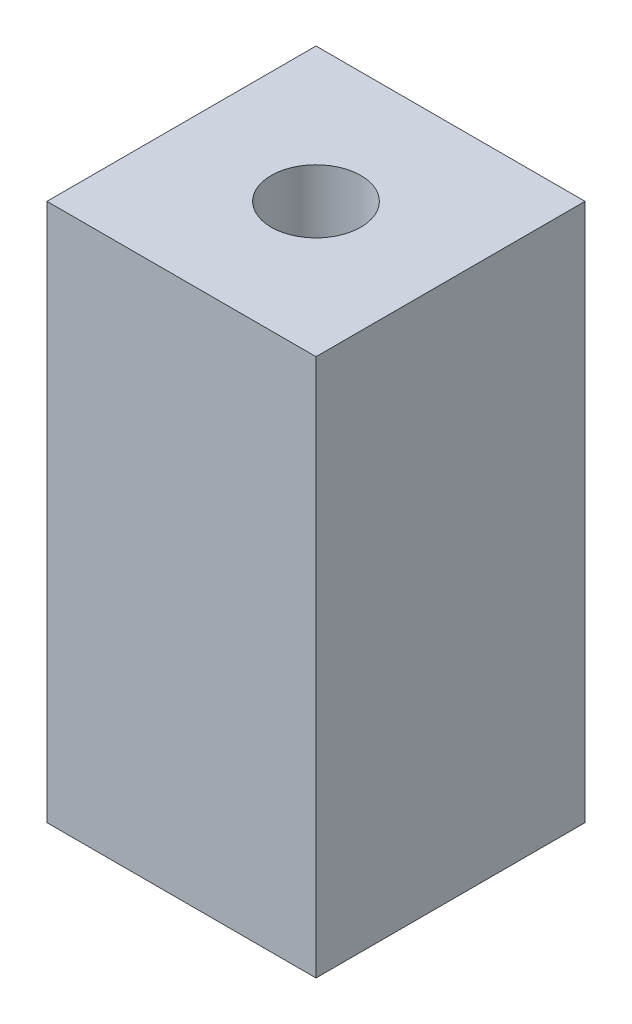
ISO-10303-21;
HEADER;
FILE_DESCRIPTION(('STEP AP214'),'2;1');
FILE_NAME('part.step','',(''),(''),'','','');
FILE_SCHEMA(('AUTOMOTIVE_DESIGN { 1 0 10303 214 1 1 1 1 }'));
ENDSEC;
DATA;
#1=APPLICATION_CONTEXT('core data for automotive mechanical design processes');
#2=APPLICATION_PROTOCOL_DEFINITION('international standard','automotive_design',2000,#1);
#3=PRODUCT_CONTEXT('',#1,'mechanical');
#4=PRODUCT('Part','Part','',(#3));
#5=PRODUCT_RELATED_PRODUCT_CATEGORY('part','',(#4));
#6=PRODUCT_DEFINITION_FORMATION('','',#4);
#7=PRODUCT_DEFINITION_CONTEXT('part definition',#1,'design');
#8=PRODUCT_DEFINITION('design','',#6,#7);
#9=PRODUCT_DEFINITION_SHAPE('','',#8);
#10=(LENGTH_UNIT() NAMED_UNIT(*) SI_UNIT(.MILLI.,.METRE.));
#11=(NAMED_UNIT(*) PLANE_ANGLE_UNIT() SI_UNIT($,.RADIAN.));
#12=(NAMED_UNIT(*) SI_UNIT($,.STERADIAN.) SOLID_ANGLE_UNIT());
#13=UNCERTAINTY_MEASURE_WITH_UNIT(LENGTH_MEASURE(1.E-05),#10,'distance_accuracy_value','');
#14=(GEOMETRIC_REPRESENTATION_CONTEXT(3) GLOBAL_UNCERTAINTY_ASSIGNED_CONTEXT((#13)) GLOBAL_UNIT_ASSIGNED_CONTEXT((#10,
#11,#12)) REPRESENTATION_CONTEXT('',''));
#15=CARTESIAN_POINT('',(0.,0.,0.));
#16=DIRECTION('',(0.,0.,1.));
#17=DIRECTION('',(1.,0.,0.));
#18=AXIS2_PLACEMENT_3D('',#15,#16,#17);
#19=CARTESIAN_POINT('',(0.,38.1,0.));
#20=DIRECTION('',(0.,-1.,0.));
#21=DIRECTION('',(0.,0.,-1.));
#22=AXIS2_PLACEMENT_3D('',#19,#20,#21);
#23=PLANE('',#22);
#24=DIRECTION('',(0.,0.,-1.));
#25=VECTOR('',#24,1.);
#26=CARTESIAN_POINT('',(9.525,38.1,9.525));
#27=LINE('',#26,#25);
#28=CARTESIAN_POINT('',(9.525,38.1,9.525));
#29=VERTEX_POINT('',#28);
#30=CARTESIAN_POINT('',(9.525,38.1,-9.525));
#31=VERTEX_POINT('',#30);
#32=EDGE_CURVE('E85',#29,#31,#27,.T.);
#33=ORIENTED_EDGE('',*,*,#32,.T.);
#34=DIRECTION('',(-1.,0.,0.));
#35=VECTOR('',#34,1.);
#36=CARTESIAN_POINT('',(-9.525,38.1,-9.525));
#37=LINE('',#36,#35);
#38=CARTESIAN_POINT('',(-9.525,38.1,-9.525));
#39=VERTEX_POINT('',#38);
#40=EDGE_CURVE('E80',#31,#39,#37,.T.);
#41=ORIENTED_EDGE('',*,*,#40,.T.);
#42=DIRECTION('',(0.,0.,1.));
#43=VECTOR('',#42,1.);
#44=CARTESIAN_POINT('',(-9.525,38.1,9.525));
#45=LINE('',#44,#43);
#46=CARTESIAN_POINT('',(-9.525,38.1,9.525));
#47=VERTEX_POINT('',#46);
#48=EDGE_CURVE('E83',#39,#47,#45,.T.);
#49=ORIENTED_EDGE('',*,*,#48,.T.);
#50=DIRECTION('',(1.,0.,0.));
#51=VECTOR('',#50,1.);
#52=CARTESIAN_POINT('',(-9.525,38.1,9.525));
#53=LINE('',#52,#51);
#54=EDGE_CURVE('E50',#47,#29,#53,.T.);
#55=ORIENTED_EDGE('',*,*,#54,.T.);
#56=EDGE_LOOP('',(#33,#41,#49,#55));
#57=FACE_BOUND('',#56,.T.);
#58=CARTESIAN_POINT('',(0.,38.1,0.));
#59=DIRECTION('',(0.,1.,0.));
#60=DIRECTION('',(0.,0.,1.));
#61=AXIS2_PLACEMENT_3D('',#58,#59,#60);
#62=CIRCLE('',#61,3.175);
#63=CARTESIAN_POINT('',(0.,38.1,3.175));
#64=VERTEX_POINT('',#63);
#65=EDGE_CURVE('E100',#64,#64,#62,.T.);
#66=ORIENTED_EDGE('',*,*,#65,.F.);
#67=EDGE_LOOP('',(#66));
#68=FACE_BOUND('',#67,.T.);
#69=ADVANCED_FACE('F33',(#57,#68),#23,.F.);
#70=CARTESIAN_POINT('',(0.,0.,0.));
#71=DIRECTION('',(0.,-1.,0.));
#72=DIRECTION('',(0.,0.,-1.));
#73=AXIS2_PLACEMENT_3D('',#70,#71,#72);
#74=PLANE('',#73);
#75=DIRECTION('',(0.,0.,-1.));
#76=VECTOR('',#75,1.);
#77=CARTESIAN_POINT('',(9.525,0.,9.525));
#78=LINE('',#77,#76);
#79=CARTESIAN_POINT('',(9.525,0.,9.525));
#80=VERTEX_POINT('',#79);
#81=CARTESIAN_POINT('',(9.525,0.,-9.525));
#82=VERTEX_POINT('',#81);
#83=EDGE_CURVE('E97',#80,#82,#78,.T.);
#84=ORIENTED_EDGE('',*,*,#83,.F.);
#85=DIRECTION('',(1.,0.,0.));
#86=VECTOR('',#85,1.);
#87=CARTESIAN_POINT('',(-9.525,0.,9.525));
#88=LINE('',#87,#86);
#89=CARTESIAN_POINT('',(-9.525,0.,9.525));
#90=VERTEX_POINT('',#89);
#91=EDGE_CURVE('E73',#90,#80,#88,.T.);
#92=ORIENTED_EDGE('',*,*,#91,.F.);
#93=DIRECTION('',(0.,0.,1.));
#94=VECTOR('',#93,1.);
#95=CARTESIAN_POINT('',(-9.525,0.,9.525));
#96=LINE('',#95,#94);
#97=CARTESIAN_POINT('',(-9.525,0.,-9.525));
#98=VERTEX_POINT('',#97);
#99=EDGE_CURVE('E67',#98,#90,#96,.T.);
#100=ORIENTED_EDGE('',*,*,#99,.F.);
#101=DIRECTION('',(-1.,0.,0.));
#102=VECTOR('',#101,1.);
#103=CARTESIAN_POINT('',(-9.525,0.,-9.525));
#104=LINE('',#103,#102);
#105=EDGE_CURVE('E89',#82,#98,#104,.T.);
#106=ORIENTED_EDGE('',*,*,#105,.F.);
#107=EDGE_LOOP('',(#84,#92,#100,#106));
#108=FACE_BOUND('',#107,.T.);
#109=CARTESIAN_POINT('',(0.,0.,0.));
#110=DIRECTION('',(0.,1.,0.));
#111=DIRECTION('',(0.,0.,1.));
#112=AXIS2_PLACEMENT_3D('',#109,#110,#111);
#113=CIRCLE('',#112,3.175);
#114=CARTESIAN_POINT('',(0.,0.,3.175));
#115=VERTEX_POINT('',#114);
#116=EDGE_CURVE('E112',#115,#115,#113,.T.);
#117=ORIENTED_EDGE('',*,*,#116,.T.);
#118=EDGE_LOOP('',(#117));
#119=FACE_BOUND('',#118,.T.);
#120=ADVANCED_FACE('F108',(#108,#119),#74,.T.);
#121=CARTESIAN_POINT('',(9.525,38.1,9.525));
#122=DIRECTION('',(-1.,0.,0.));
#123=DIRECTION('',(0.,0.,1.));
#124=AXIS2_PLACEMENT_3D('',#121,#122,#123);
#125=PLANE('',#124);
#126=ORIENTED_EDGE('',*,*,#83,.T.);
#127=DIRECTION('',(0.,-1.,0.));
#128=VECTOR('',#127,1.);
#129=CARTESIAN_POINT('',(9.525,38.1,-9.525));
#130=LINE('',#129,#128);
#131=EDGE_CURVE('E11',#31,#82,#130,.T.);
#132=ORIENTED_EDGE('',*,*,#131,.F.);
#133=ORIENTED_EDGE('',*,*,#32,.F.);
#134=DIRECTION('',(0.,-1.,0.));
#135=VECTOR('',#134,1.);
#136=CARTESIAN_POINT('',(9.525,38.1,9.525));
#137=LINE('',#136,#135);
#138=EDGE_CURVE('E93',#29,#80,#137,.T.);
#139=ORIENTED_EDGE('',*,*,#138,.T.);
#140=EDGE_LOOP('',(#126,#132,#133,#139));
#141=FACE_BOUND('',#140,.T.);
#142=ADVANCED_FACE('F35',(#141),#125,.F.);
#143=CARTESIAN_POINT('',(-9.525,38.1,-9.525));
#144=DIRECTION('',(0.,0.,1.));
#145=DIRECTION('',(1.,0.,0.));
#146=AXIS2_PLACEMENT_3D('',#143,#144,#145);
#147=PLANE('',#146);
#148=ORIENTED_EDGE('',*,*,#105,.T.);
#149=DIRECTION('',(0.,-1.,0.));
#150=VECTOR('',#149,1.);
#151=CARTESIAN_POINT('',(-9.525,38.1,-9.525));
#152=LINE('',#151,#150);
#153=EDGE_CURVE('E42',#39,#98,#152,.T.);
#154=ORIENTED_EDGE('',*,*,#153,.F.);
#155=ORIENTED_EDGE('',*,*,#40,.F.);
#156=ORIENTED_EDGE('',*,*,#131,.T.);
#157=EDGE_LOOP('',(#148,#154,#155,#156));
#158=FACE_BOUND('',#157,.T.);
#159=ADVANCED_FACE('F88',(#158),#147,.F.);
#160=CARTESIAN_POINT('',(-9.525,38.1,9.525));
#161=DIRECTION('',(1.,0.,0.));
#162=DIRECTION('',(0.,0.,-1.));
#163=AXIS2_PLACEMENT_3D('',#160,#161,#162);
#164=PLANE('',#163);
#165=ORIENTED_EDGE('',*,*,#99,.T.);
#166=DIRECTION('',(0.,-1.,0.));
#167=VECTOR('',#166,1.);
#168=CARTESIAN_POINT('',(-9.525,38.1,9.525));
#169=LINE('',#168,#167);
#170=EDGE_CURVE('E90',#47,#90,#169,.T.);
#171=ORIENTED_EDGE('',*,*,#170,.F.);
#172=ORIENTED_EDGE('',*,*,#48,.F.);
#173=ORIENTED_EDGE('',*,*,#153,.T.);
#174=EDGE_LOOP('',(#165,#171,#172,#173));
#175=FACE_BOUND('',#174,.T.);
#176=ADVANCED_FACE('F91',(#175),#164,.F.);
#177=CARTESIAN_POINT('',(-9.525,38.1,9.525));
#178=DIRECTION('',(0.,0.,-1.));
#179=DIRECTION('',(-1.,0.,0.));
#180=AXIS2_PLACEMENT_3D('',#177,#178,#179);
#181=PLANE('',#180);
#182=ORIENTED_EDGE('',*,*,#91,.T.);
#183=ORIENTED_EDGE('',*,*,#138,.F.);
#184=ORIENTED_EDGE('',*,*,#54,.F.);
#185=ORIENTED_EDGE('',*,*,#170,.T.);
#186=EDGE_LOOP('',(#182,#183,#184,#185));
#187=FACE_BOUND('',#186,.T.);
#188=ADVANCED_FACE('F105',(#187),#181,.F.);
#189=CARTESIAN_POINT('',(0.,38.1,0.));
#190=DIRECTION('',(0.,-1.,0.));
#191=DIRECTION('',(0.,0.,-1.));
#192=AXIS2_PLACEMENT_3D('',#189,#190,#191);
#193=CYLINDRICAL_SURFACE('',#192,3.175);
#194=ORIENTED_EDGE('',*,*,#65,.T.);
#195=EDGE_LOOP('',(#194));
#196=FACE_BOUND('',#195,.T.);
#197=ORIENTED_EDGE('',*,*,#116,.F.);
#198=EDGE_LOOP('',(#197));
#199=FACE_BOUND('',#198,.T.);
#200=ADVANCED_FACE('F118',(#196,#199),#193,.F.);
#201=CLOSED_SHELL('',(#69,#120,#142,#159,#176,#188,#200));
#202=MANIFOLD_SOLID_BREP('B2',#201);
#203=ADVANCED_BREP_SHAPE_REPRESENTATION('',(#18,#202),#14);
#204=SHAPE_DEFINITION_REPRESENTATION(#9,#203);
ENDSEC;
END-ISO-10303-21;
